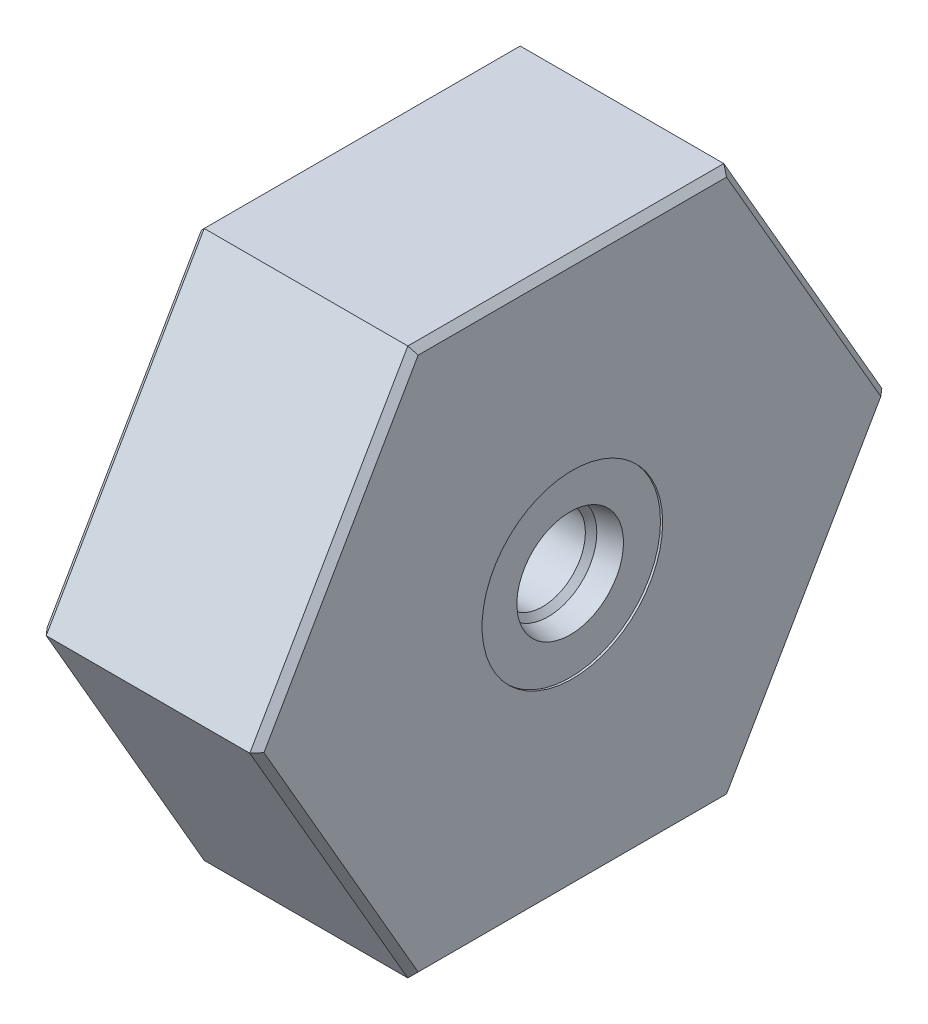
ISO-10303-21;
HEADER;
FILE_DESCRIPTION(('STEP AP214'),'2;1');
FILE_NAME('part.step','',(''),(''),'','','');
FILE_SCHEMA(('AUTOMOTIVE_DESIGN { 1 0 10303 214 1 1 1 1 }'));
ENDSEC;
DATA;
#1=APPLICATION_CONTEXT('core data for automotive mechanical design processes');
#2=APPLICATION_PROTOCOL_DEFINITION('international standard','automotive_design',2000,#1);
#3=PRODUCT_CONTEXT('',#1,'mechanical');
#4=PRODUCT('Part','Part','',(#3));
#5=PRODUCT_RELATED_PRODUCT_CATEGORY('part','',(#4));
#6=PRODUCT_DEFINITION_FORMATION('','',#4);
#7=PRODUCT_DEFINITION_CONTEXT('part definition',#1,'design');
#8=PRODUCT_DEFINITION('design','',#6,#7);
#9=PRODUCT_DEFINITION_SHAPE('','',#8);
#10=(LENGTH_UNIT() NAMED_UNIT(*) SI_UNIT(.MILLI.,.METRE.));
#11=(NAMED_UNIT(*) PLANE_ANGLE_UNIT() SI_UNIT($,.RADIAN.));
#12=(NAMED_UNIT(*) SI_UNIT($,.STERADIAN.) SOLID_ANGLE_UNIT());
#13=UNCERTAINTY_MEASURE_WITH_UNIT(LENGTH_MEASURE(1.E-05),#10,'distance_accuracy_value','');
#14=(GEOMETRIC_REPRESENTATION_CONTEXT(3) GLOBAL_UNCERTAINTY_ASSIGNED_CONTEXT((#13)) GLOBAL_UNIT_ASSIGNED_CONTEXT((#10,
#11,#12)) REPRESENTATION_CONTEXT('',''));
#15=CARTESIAN_POINT('',(0.,0.,0.));
#16=DIRECTION('',(0.,0.,1.));
#17=DIRECTION('',(1.,0.,0.));
#18=AXIS2_PLACEMENT_3D('',#15,#16,#17);
#19=CARTESIAN_POINT('',(25.146,-31.75,-18.3308710467706));
#20=DIRECTION('',(0.,-1.,0.));
#21=DIRECTION('',(0.,0.,-1.));
#22=AXIS2_PLACEMENT_3D('',#19,#20,#21);
#23=PLANE('',#22);
#24=DIRECTION('',(-1.,0.,0.));
#25=VECTOR('',#24,1.);
#26=CARTESIAN_POINT('',(25.146,-31.75,-18.3308710467706));
#27=LINE('',#26,#25);
#28=CARTESIAN_POINT('',(24.384,-31.75,-18.3308710467706));
#29=VERTEX_POINT('',#28);
#30=CARTESIAN_POINT('',(0.761999999999999,-31.75,-18.3308710467706));
#31=VERTEX_POINT('',#30);
#32=EDGE_CURVE('E261',#29,#31,#27,.T.);
#33=ORIENTED_EDGE('',*,*,#32,.F.);
#34=DIRECTION('',(0.,0.,1.));
#35=VECTOR('',#34,1.);
#36=CARTESIAN_POINT('',(24.384,-31.75,18.3308710467706));
#37=LINE('',#36,#35);
#38=CARTESIAN_POINT('',(24.384,-31.75,18.3308710467706));
#39=VERTEX_POINT('',#38);
#40=EDGE_CURVE('E42',#29,#39,#37,.T.);
#41=ORIENTED_EDGE('',*,*,#40,.T.);
#42=DIRECTION('',(-1.,0.,0.));
#43=VECTOR('',#42,1.);
#44=CARTESIAN_POINT('',(25.146,-31.75,18.3308710467706));
#45=LINE('',#44,#43);
#46=CARTESIAN_POINT('',(0.761999999999999,-31.75,18.3308710467706));
#47=VERTEX_POINT('',#46);
#48=EDGE_CURVE('E237',#39,#47,#45,.T.);
#49=ORIENTED_EDGE('',*,*,#48,.T.);
#50=DIRECTION('',(0.,0.,-1.));
#51=VECTOR('',#50,1.);
#52=CARTESIAN_POINT('',(0.761999999999999,-31.75,-18.3308710467706));
#53=LINE('',#52,#51);
#54=EDGE_CURVE('E150',#47,#31,#53,.T.);
#55=ORIENTED_EDGE('',*,*,#54,.T.);
#56=EDGE_LOOP('',(#33,#41,#49,#55));
#57=FACE_BOUND('',#56,.T.);
#58=ADVANCED_FACE('F33',(#57),#23,.T.);
#59=CARTESIAN_POINT('',(25.146,0.,-36.6617420935412));
#60=DIRECTION('',(0.,-0.5,-0.866025403784439));
#61=DIRECTION('',(0.,0.866025403784439,-0.5));
#62=AXIS2_PLACEMENT_3D('',#59,#60,#61);
#63=PLANE('',#62);
#64=DIRECTION('',(-1.,0.,0.));
#65=VECTOR('',#64,1.);
#66=CARTESIAN_POINT('',(25.146,0.,-36.6617420935412));
#67=LINE('',#66,#65);
#68=CARTESIAN_POINT('',(24.384,0.,-36.6617420935412));
#69=VERTEX_POINT('',#68);
#70=CARTESIAN_POINT('',(0.761999999999999,0.,-36.6617420935412));
#71=VERTEX_POINT('',#70);
#72=EDGE_CURVE('E259',#69,#71,#67,.T.);
#73=ORIENTED_EDGE('',*,*,#72,.F.);
#74=DIRECTION('',(0.,-0.866025403784439,0.5));
#75=VECTOR('',#74,1.);
#76=CARTESIAN_POINT('',(24.384,-31.75,-18.3308710467706));
#77=LINE('',#76,#75);
#78=EDGE_CURVE('E179',#69,#29,#77,.T.);
#79=ORIENTED_EDGE('',*,*,#78,.T.);
#80=ORIENTED_EDGE('',*,*,#32,.T.);
#81=DIRECTION('',(0.,0.866025403784439,-0.5));
#82=VECTOR('',#81,1.);
#83=CARTESIAN_POINT('',(0.761999999999995,0.,-36.6617420935412));
#84=LINE('',#83,#82);
#85=EDGE_CURVE('E218',#31,#71,#84,.T.);
#86=ORIENTED_EDGE('',*,*,#85,.T.);
#87=EDGE_LOOP('',(#73,#79,#80,#86));
#88=FACE_BOUND('',#87,.T.);
#89=ADVANCED_FACE('F342',(#88),#63,.T.);
#90=CARTESIAN_POINT('',(25.146,31.75,-18.3308710467706));
#91=DIRECTION('',(0.,0.5,-0.866025403784439));
#92=DIRECTION('',(0.,0.866025403784439,0.5));
#93=AXIS2_PLACEMENT_3D('',#90,#91,#92);
#94=PLANE('',#93);
#95=DIRECTION('',(-1.,0.,0.));
#96=VECTOR('',#95,1.);
#97=CARTESIAN_POINT('',(25.146,31.75,-18.3308710467706));
#98=LINE('',#97,#96);
#99=CARTESIAN_POINT('',(24.384,31.75,-18.3308710467706));
#100=VERTEX_POINT('',#99);
#101=CARTESIAN_POINT('',(0.761999999999999,31.75,-18.3308710467706));
#102=VERTEX_POINT('',#101);
#103=EDGE_CURVE('E257',#100,#102,#98,.T.);
#104=ORIENTED_EDGE('',*,*,#103,.F.);
#105=DIRECTION('',(0.,-0.866025403784439,-0.5));
#106=VECTOR('',#105,1.);
#107=CARTESIAN_POINT('',(24.384,0.,-36.6617420935412));
#108=LINE('',#107,#106);
#109=EDGE_CURVE('E160',#100,#69,#108,.T.);
#110=ORIENTED_EDGE('',*,*,#109,.T.);
#111=ORIENTED_EDGE('',*,*,#72,.T.);
#112=DIRECTION('',(0.,0.866025403784439,0.5));
#113=VECTOR('',#112,1.);
#114=CARTESIAN_POINT('',(0.762000000000002,31.75,-18.3308710467706));
#115=LINE('',#114,#113);
#116=EDGE_CURVE('E222',#71,#102,#115,.T.);
#117=ORIENTED_EDGE('',*,*,#116,.T.);
#118=EDGE_LOOP('',(#104,#110,#111,#117));
#119=FACE_BOUND('',#118,.T.);
#120=ADVANCED_FACE('F256',(#119),#94,.T.);
#121=CARTESIAN_POINT('',(25.146,31.75,18.3308710467706));
#122=DIRECTION('',(0.,1.,0.));
#123=DIRECTION('',(0.,0.,1.));
#124=AXIS2_PLACEMENT_3D('',#121,#122,#123);
#125=PLANE('',#124);
#126=DIRECTION('',(-1.,0.,0.));
#127=VECTOR('',#126,1.);
#128=CARTESIAN_POINT('',(25.146,31.75,18.3308710467706));
#129=LINE('',#128,#127);
#130=CARTESIAN_POINT('',(24.384,31.75,18.3308710467706));
#131=VERTEX_POINT('',#130);
#132=CARTESIAN_POINT('',(0.761999999999999,31.75,18.3308710467706));
#133=VERTEX_POINT('',#132);
#134=EDGE_CURVE('E265',#131,#133,#129,.T.);
#135=ORIENTED_EDGE('',*,*,#134,.F.);
#136=DIRECTION('',(0.,0.,-1.));
#137=VECTOR('',#136,1.);
#138=CARTESIAN_POINT('',(24.384,31.75,-18.3308710467706));
#139=LINE('',#138,#137);
#140=EDGE_CURVE('E177',#131,#100,#139,.T.);
#141=ORIENTED_EDGE('',*,*,#140,.T.);
#142=ORIENTED_EDGE('',*,*,#103,.T.);
#143=DIRECTION('',(0.,0.,1.));
#144=VECTOR('',#143,1.);
#145=CARTESIAN_POINT('',(0.761999999999999,31.75,18.3308710467706));
#146=LINE('',#145,#144);
#147=EDGE_CURVE('E221',#102,#133,#146,.T.);
#148=ORIENTED_EDGE('',*,*,#147,.T.);
#149=EDGE_LOOP('',(#135,#141,#142,#148));
#150=FACE_BOUND('',#149,.T.);
#151=ADVANCED_FACE('F395',(#150),#125,.T.);
#152=CARTESIAN_POINT('',(25.146,0.,36.6617420935412));
#153=DIRECTION('',(0.,0.5,0.866025403784439));
#154=DIRECTION('',(0.,-0.866025403784439,0.5));
#155=AXIS2_PLACEMENT_3D('',#152,#153,#154);
#156=PLANE('',#155);
#157=DIRECTION('',(-1.,0.,0.));
#158=VECTOR('',#157,1.);
#159=CARTESIAN_POINT('',(25.146,0.,36.6617420935412));
#160=LINE('',#159,#158);
#161=CARTESIAN_POINT('',(24.384,0.,36.6617420935412));
#162=VERTEX_POINT('',#161);
#163=CARTESIAN_POINT('',(0.761999999999999,0.,36.6617420935412));
#164=VERTEX_POINT('',#163);
#165=EDGE_CURVE('E238',#162,#164,#160,.T.);
#166=ORIENTED_EDGE('',*,*,#165,.F.);
#167=DIRECTION('',(0.,0.866025403784439,-0.5));
#168=VECTOR('',#167,1.);
#169=CARTESIAN_POINT('',(24.384,31.75,18.3308710467706));
#170=LINE('',#169,#168);
#171=EDGE_CURVE('E181',#162,#131,#170,.T.);
#172=ORIENTED_EDGE('',*,*,#171,.T.);
#173=ORIENTED_EDGE('',*,*,#134,.T.);
#174=DIRECTION('',(0.,-0.866025403784439,0.5));
#175=VECTOR('',#174,1.);
#176=CARTESIAN_POINT('',(0.761999999999995,0.,36.6617420935412));
#177=LINE('',#176,#175);
#178=EDGE_CURVE('E231',#133,#164,#177,.T.);
#179=ORIENTED_EDGE('',*,*,#178,.T.);
#180=EDGE_LOOP('',(#166,#172,#173,#179));
#181=FACE_BOUND('',#180,.T.);
#182=ADVANCED_FACE('F338',(#181),#156,.T.);
#183=CARTESIAN_POINT('',(25.146,-31.75,18.3308710467706));
#184=DIRECTION('',(0.,-0.5,0.866025403784439));
#185=DIRECTION('',(0.,-0.866025403784439,-0.5));
#186=AXIS2_PLACEMENT_3D('',#183,#184,#185);
#187=PLANE('',#186);
#188=ORIENTED_EDGE('',*,*,#48,.F.);
#189=DIRECTION('',(0.,0.866025403784439,0.5));
#190=VECTOR('',#189,1.);
#191=CARTESIAN_POINT('',(24.384,0.,36.6617420935412));
#192=LINE('',#191,#190);
#193=EDGE_CURVE('E11',#39,#162,#192,.T.);
#194=ORIENTED_EDGE('',*,*,#193,.T.);
#195=ORIENTED_EDGE('',*,*,#165,.T.);
#196=DIRECTION('',(0.,-0.866025403784439,-0.5));
#197=VECTOR('',#196,1.);
#198=CARTESIAN_POINT('',(0.761999999999999,-31.75,18.3308710467706));
#199=LINE('',#198,#197);
#200=EDGE_CURVE('E164',#164,#47,#199,.T.);
#201=ORIENTED_EDGE('',*,*,#200,.T.);
#202=EDGE_LOOP('',(#188,#194,#195,#201));
#203=FACE_BOUND('',#202,.T.);
#204=ADVANCED_FACE('F236',(#203),#187,.T.);
#205=CARTESIAN_POINT('',(25.146,-31.75,18.3308710467706));
#206=DIRECTION('',(-1.,0.,0.));
#207=DIRECTION('',(0.,0.,1.));
#208=AXIS2_PLACEMENT_3D('',#205,#206,#207);
#209=PLANE('',#208);
#210=DIRECTION('',(0.,0.866025403784439,-0.5));
#211=VECTOR('',#210,1.);
#212=CARTESIAN_POINT('',(25.146,0.381000000000001,-36.0018307358575));
#213=LINE('',#212,#211);
#214=CARTESIAN_POINT('',(25.146,-30.988,-17.8909301416481));
#215=VERTEX_POINT('',#214);
#216=CARTESIAN_POINT('',(25.146,0.,-35.7818602832962));
#217=VERTEX_POINT('',#216);
#218=EDGE_CURVE('E170',#215,#217,#213,.T.);
#219=ORIENTED_EDGE('',*,*,#218,.T.);
#220=DIRECTION('',(0.,0.866025403784439,0.5));
#221=VECTOR('',#220,1.);
#222=CARTESIAN_POINT('',(25.146,31.369,-17.6709596890869));
#223=LINE('',#222,#221);
#224=CARTESIAN_POINT('',(25.146,30.988,-17.8909301416481));
#225=VERTEX_POINT('',#224);
#226=EDGE_CURVE('E174',#217,#225,#223,.T.);
#227=ORIENTED_EDGE('',*,*,#226,.T.);
#228=DIRECTION('',(0.,0.,1.));
#229=VECTOR('',#228,1.);
#230=CARTESIAN_POINT('',(25.146,30.988,18.3308710467706));
#231=LINE('',#230,#229);
#232=CARTESIAN_POINT('',(25.146,30.988,17.8909301416481));
#233=VERTEX_POINT('',#232);
#234=EDGE_CURVE('E172',#225,#233,#231,.T.);
#235=ORIENTED_EDGE('',*,*,#234,.T.);
#236=DIRECTION('',(0.,-0.866025403784439,0.5));
#237=VECTOR('',#236,1.);
#238=CARTESIAN_POINT('',(25.146,-0.381000000000001,36.0018307358575));
#239=LINE('',#238,#237);
#240=CARTESIAN_POINT('',(25.146,0.,35.7818602832962));
#241=VERTEX_POINT('',#240);
#242=EDGE_CURVE('E168',#233,#241,#239,.T.);
#243=ORIENTED_EDGE('',*,*,#242,.T.);
#244=DIRECTION('',(0.,-0.866025403784439,-0.5));
#245=VECTOR('',#244,1.);
#246=CARTESIAN_POINT('',(25.146,-31.369,17.6709596890869));
#247=LINE('',#246,#245);
#248=CARTESIAN_POINT('',(25.146,-30.988,17.8909301416481));
#249=VERTEX_POINT('',#248);
#250=EDGE_CURVE('E163',#241,#249,#247,.T.);
#251=ORIENTED_EDGE('',*,*,#250,.T.);
#252=DIRECTION('',(0.,0.,-1.));
#253=VECTOR('',#252,1.);
#254=CARTESIAN_POINT('',(25.146,-30.988,-18.3308710467706));
#255=LINE('',#254,#253);
#256=EDGE_CURVE('E166',#249,#215,#255,.T.);
#257=ORIENTED_EDGE('',*,*,#256,.T.);
#258=EDGE_LOOP('',(#219,#227,#235,#243,#251,#257));
#259=FACE_BOUND('',#258,.T.);
#260=CARTESIAN_POINT('',(25.146,0.,0.));
#261=DIRECTION('',(1.,0.,0.));
#262=DIRECTION('',(0.,0.,-1.));
#263=AXIS2_PLACEMENT_3D('',#260,#261,#262);
#264=CIRCLE('',#263,10.4774999999981);
#265=CARTESIAN_POINT('',(25.146,0.,-10.4774999999981));
#266=VERTEX_POINT('',#265);
#267=EDGE_CURVE('E272',#266,#266,#264,.T.);
#268=ORIENTED_EDGE('',*,*,#267,.F.);
#269=EDGE_LOOP('',(#268));
#270=FACE_BOUND('',#269,.T.);
#271=ADVANCED_FACE('F328',(#259,#270),#209,.F.);
#272=CARTESIAN_POINT('',(0.,-31.75,18.3308710467706));
#273=DIRECTION('',(-1.,0.,0.));
#274=DIRECTION('',(0.,0.,1.));
#275=AXIS2_PLACEMENT_3D('',#272,#273,#274);
#276=PLANE('',#275);
#277=DIRECTION('',(0.,0.,-1.));
#278=VECTOR('',#277,1.);
#279=CARTESIAN_POINT('',(0.,30.988,18.3308710467706));
#280=LINE('',#279,#278);
#281=CARTESIAN_POINT('',(0.,30.988,17.8909301416481));
#282=VERTEX_POINT('',#281);
#283=CARTESIAN_POINT('',(0.,30.988,-17.8909301416481));
#284=VERTEX_POINT('',#283);
#285=EDGE_CURVE('E134',#282,#284,#280,.T.);
#286=ORIENTED_EDGE('',*,*,#285,.T.);
#287=DIRECTION('',(0.,-0.866025403784439,-0.5));
#288=VECTOR('',#287,1.);
#289=CARTESIAN_POINT('',(0.,-0.381000000000013,-36.0018307358575));
#290=LINE('',#289,#288);
#291=CARTESIAN_POINT('',(0.,0.,-35.7818602832962));
#292=VERTEX_POINT('',#291);
#293=EDGE_CURVE('E227',#284,#292,#290,.T.);
#294=ORIENTED_EDGE('',*,*,#293,.T.);
#295=DIRECTION('',(0.,-0.866025403784439,0.5));
#296=VECTOR('',#295,1.);
#297=CARTESIAN_POINT('',(0.,-47.244,-8.50552416570158));
#298=LINE('',#297,#296);
#299=CARTESIAN_POINT('',(0.,-30.988,-17.8909301416481));
#300=VERTEX_POINT('',#299);
#301=EDGE_CURVE('E129',#292,#300,#298,.T.);
#302=ORIENTED_EDGE('',*,*,#301,.T.);
#303=DIRECTION('',(0.,0.,1.));
#304=VECTOR('',#303,1.);
#305=CARTESIAN_POINT('',(0.,-30.988,18.3308710467706));
#306=LINE('',#305,#304);
#307=CARTESIAN_POINT('',(0.,-30.988,17.8909301416481));
#308=VERTEX_POINT('',#307);
#309=EDGE_CURVE('E121',#300,#308,#306,.T.);
#310=ORIENTED_EDGE('',*,*,#309,.T.);
#311=DIRECTION('',(0.,0.866025403784439,0.5));
#312=VECTOR('',#311,1.);
#313=CARTESIAN_POINT('',(0.,-31.369,17.6709596890869));
#314=LINE('',#313,#312);
#315=CARTESIAN_POINT('',(0.,0.,35.7818602832962));
#316=VERTEX_POINT('',#315);
#317=EDGE_CURVE('E125',#308,#316,#314,.T.);
#318=ORIENTED_EDGE('',*,*,#317,.T.);
#319=DIRECTION('',(0.,0.866025403784439,-0.5));
#320=VECTOR('',#319,1.);
#321=CARTESIAN_POINT('',(0.,-16.256,45.1672662592428));
#322=LINE('',#321,#320);
#323=EDGE_CURVE('E135',#316,#282,#322,.T.);
#324=ORIENTED_EDGE('',*,*,#323,.T.);
#325=EDGE_LOOP('',(#286,#294,#302,#310,#318,#324));
#326=FACE_BOUND('',#325,.T.);
#327=CARTESIAN_POINT('',(0.,0.,0.));
#328=DIRECTION('',(-1.,0.,0.));
#329=DIRECTION('',(0.,0.,1.));
#330=AXIS2_PLACEMENT_3D('',#327,#328,#329);
#331=CIRCLE('',#330,28.0542999999999);
#332=CARTESIAN_POINT('',(0.,0.,28.0542999999999));
#333=VERTEX_POINT('',#332);
#334=EDGE_CURVE('E263',#333,#333,#331,.F.);
#335=ORIENTED_EDGE('',*,*,#334,.T.);
#336=EDGE_LOOP('',(#335));
#337=FACE_BOUND('',#336,.T.);
#338=ADVANCED_FACE('F123',(#326,#337),#276,.T.);
#339=CARTESIAN_POINT('',(0.,0.,0.));
#340=DIRECTION('',(1.,0.,0.));
#341=DIRECTION('',(0.,0.,-1.));
#342=AXIS2_PLACEMENT_3D('',#339,#340,#341);
#343=CYLINDRICAL_SURFACE('',#342,27.8003);
#344=CARTESIAN_POINT('',(0.253999999999931,0.,0.));
#345=DIRECTION('',(-1.,0.,0.));
#346=DIRECTION('',(0.,0.,1.));
#347=AXIS2_PLACEMENT_3D('',#344,#345,#346);
#348=CIRCLE('',#347,27.8003);
#349=CARTESIAN_POINT('',(0.253999999999931,0.,27.8003));
#350=VERTEX_POINT('',#349);
#351=EDGE_CURVE('E275',#350,#350,#348,.T.);
#352=ORIENTED_EDGE('',*,*,#351,.T.);
#353=EDGE_LOOP('',(#352));
#354=FACE_BOUND('',#353,.T.);
#355=CARTESIAN_POINT('',(12.2344103093925,0.,0.));
#356=DIRECTION('',(1.,0.,0.));
#357=DIRECTION('',(0.,0.,-1.));
#358=AXIS2_PLACEMENT_3D('',#355,#356,#357);
#359=CIRCLE('',#358,27.8003);
#360=CARTESIAN_POINT('',(12.2344103093925,0.,-27.8003));
#361=VERTEX_POINT('',#360);
#362=EDGE_CURVE('E312',#361,#361,#359,.T.);
#363=ORIENTED_EDGE('',*,*,#362,.T.);
#364=EDGE_LOOP('',(#363));
#365=FACE_BOUND('',#364,.T.);
#366=ADVANCED_FACE('F336',(#354,#365),#343,.F.);
#367=CARTESIAN_POINT('',(0.,0.,0.));
#368=DIRECTION('',(1.,0.,0.));
#369=DIRECTION('',(0.,0.,-1.));
#370=AXIS2_PLACEMENT_3D('',#367,#368,#369);
#371=CYLINDRICAL_SURFACE('',#370,10.4774999999981);
#372=CARTESIAN_POINT('',(24.8920000000245,0.,0.));
#373=DIRECTION('',(1.,0.,0.));
#374=DIRECTION('',(0.,0.,-1.));
#375=AXIS2_PLACEMENT_3D('',#372,#373,#374);
#376=CIRCLE('',#375,10.4774999999981);
#377=CARTESIAN_POINT('',(24.8920000000245,0.,-10.4774999999981));
#378=VERTEX_POINT('',#377);
#379=EDGE_CURVE('E321',#378,#378,#376,.T.);
#380=ORIENTED_EDGE('',*,*,#379,.F.);
#381=EDGE_LOOP('',(#380));
#382=FACE_BOUND('',#381,.T.);
#383=ORIENTED_EDGE('',*,*,#267,.T.);
#384=EDGE_LOOP('',(#383));
#385=FACE_BOUND('',#384,.T.);
#386=ADVANCED_FACE('F326',(#382,#385),#371,.F.);
#387=CARTESIAN_POINT('',(24.8920000000245,10.4774999999981,0.));
#388=DIRECTION('',(-1.,0.,0.));
#389=DIRECTION('',(0.,0.,1.));
#390=AXIS2_PLACEMENT_3D('',#387,#388,#389);
#391=PLANE('',#390);
#392=CARTESIAN_POINT('',(24.8920000000245,0.,0.));
#393=DIRECTION('',(1.,0.,0.));
#394=DIRECTION('',(0.,0.,-1.));
#395=AXIS2_PLACEMENT_3D('',#392,#393,#394);
#396=CIRCLE('',#395,6.18490000001606);
#397=CARTESIAN_POINT('',(24.8920000000245,0.,-6.18490000001606));
#398=VERTEX_POINT('',#397);
#399=EDGE_CURVE('E318',#398,#398,#396,.T.);
#400=ORIENTED_EDGE('',*,*,#399,.F.);
#401=EDGE_LOOP('',(#400));
#402=FACE_BOUND('',#401,.T.);
#403=ORIENTED_EDGE('',*,*,#379,.T.);
#404=EDGE_LOOP('',(#403));
#405=FACE_BOUND('',#404,.T.);
#406=ADVANCED_FACE('F566',(#402,#405),#391,.F.);
#407=CARTESIAN_POINT('',(24.8920000000245,0.,0.));
#408=DIRECTION('',(1.,0.,0.));
#409=DIRECTION('',(0.,0.,-1.));
#410=AXIS2_PLACEMENT_3D('',#407,#408,#409);
#411=CONICAL_SURFACE('',#410,6.18490000001606,0.209439510243191);
#412=CARTESIAN_POINT('',(22.3393000000007,0.,0.));
#413=DIRECTION('',(1.,0.,0.));
#414=DIRECTION('',(0.,0.,-1.));
#415=AXIS2_PLACEMENT_3D('',#412,#413,#414);
#416=CIRCLE('',#415,5.6423068650256);
#417=CARTESIAN_POINT('',(22.3393000000007,0.,-5.6423068650256));
#418=VERTEX_POINT('',#417);
#419=EDGE_CURVE('E309',#418,#418,#416,.T.);
#420=ORIENTED_EDGE('',*,*,#419,.F.);
#421=EDGE_LOOP('',(#420));
#422=FACE_BOUND('',#421,.T.);
#423=ORIENTED_EDGE('',*,*,#399,.T.);
#424=EDGE_LOOP('',(#423));
#425=FACE_BOUND('',#424,.T.);
#426=ADVANCED_FACE('F557',(#422,#425),#411,.F.);
#427=CARTESIAN_POINT('',(22.3393000000007,0.,0.));
#428=DIRECTION('',(1.,0.,0.));
#429=DIRECTION('',(0.,0.,-1.));
#430=AXIS2_PLACEMENT_3D('',#427,#428,#429);
#431=CONICAL_SURFACE('',#430,5.6423068650256,0.785398163397452);
#432=CARTESIAN_POINT('',(21.6753931349751,0.,0.));
#433=DIRECTION('',(1.,0.,0.));
#434=DIRECTION('',(0.,0.,-1.));
#435=AXIS2_PLACEMENT_3D('',#432,#433,#434);
#436=CIRCLE('',#435,4.97839999999999);
#437=CARTESIAN_POINT('',(21.6753931349751,0.,-4.97839999999999));
#438=VERTEX_POINT('',#437);
#439=EDGE_CURVE('E305',#438,#438,#436,.T.);
#440=ORIENTED_EDGE('',*,*,#439,.F.);
#441=EDGE_LOOP('',(#440));
#442=FACE_BOUND('',#441,.T.);
#443=ORIENTED_EDGE('',*,*,#419,.T.);
#444=EDGE_LOOP('',(#443));
#445=FACE_BOUND('',#444,.T.);
#446=ADVANCED_FACE('F550',(#442,#445),#431,.F.);
#447=CARTESIAN_POINT('',(0.,0.,0.));
#448=DIRECTION('',(1.,0.,0.));
#449=DIRECTION('',(0.,0.,-1.));
#450=AXIS2_PLACEMENT_3D('',#447,#448,#449);
#451=CYLINDRICAL_SURFACE('',#450,4.9784);
#452=CARTESIAN_POINT('',(15.748,0.,0.));
#453=DIRECTION('',(1.,0.,0.));
#454=DIRECTION('',(0.,0.,-1.));
#455=AXIS2_PLACEMENT_3D('',#452,#453,#454);
#456=CIRCLE('',#455,4.9784);
#457=CARTESIAN_POINT('',(15.748,0.,-4.9784));
#458=VERTEX_POINT('',#457);
#459=EDGE_CURVE('E146',#458,#458,#456,.F.);
#460=ORIENTED_EDGE('',*,*,#459,.T.);
#461=EDGE_LOOP('',(#460));
#462=FACE_BOUND('',#461,.T.);
#463=ORIENTED_EDGE('',*,*,#439,.T.);
#464=EDGE_LOOP('',(#463));
#465=FACE_BOUND('',#464,.T.);
#466=ADVANCED_FACE('F283',(#462,#465),#451,.F.);
#467=CARTESIAN_POINT('',(14.986,4.9784,0.));
#468=DIRECTION('',(1.,0.,0.));
#469=DIRECTION('',(0.,0.,-1.));
#470=AXIS2_PLACEMENT_3D('',#467,#468,#469);
#471=PLANE('',#470);
#472=CARTESIAN_POINT('',(14.986,0.,0.));
#473=DIRECTION('',(1.,0.,0.));
#474=DIRECTION('',(0.,0.,-1.));
#475=AXIS2_PLACEMENT_3D('',#472,#473,#474);
#476=CIRCLE('',#475,5.74039999999998);
#477=CARTESIAN_POINT('',(14.986,0.,-5.74039999999998));
#478=VERTEX_POINT('',#477);
#479=EDGE_CURVE('E278',#478,#478,#476,.T.);
#480=ORIENTED_EDGE('',*,*,#479,.T.);
#481=EDGE_LOOP('',(#480));
#482=FACE_BOUND('',#481,.T.);
#483=CARTESIAN_POINT('',(14.986,15.24,0.));
#484=DIRECTION('',(-1.,0.,0.));
#485=DIRECTION('',(0.,0.,1.));
#486=AXIS2_PLACEMENT_3D('',#483,#484,#485);
#487=CIRCLE('',#486,8.00100000000001);
#488=CARTESIAN_POINT('',(14.986,15.24,8.00100000000001));
#489=VERTEX_POINT('',#488);
#490=EDGE_CURVE('E153',#489,#489,#487,.T.);
#491=ORIENTED_EDGE('',*,*,#490,.F.);
#492=EDGE_LOOP('',(#491));
#493=FACE_BOUND('',#492,.T.);
#494=CARTESIAN_POINT('',(14.986,0.,0.));
#495=DIRECTION('',(1.,0.,0.));
#496=DIRECTION('',(0.,0.,-1.));
#497=AXIS2_PLACEMENT_3D('',#494,#495,#496);
#498=CIRCLE('',#497,27.4955);
#499=CARTESIAN_POINT('',(14.986,0.,-27.4955));
#500=VERTEX_POINT('',#499);
#501=EDGE_CURVE('E303',#500,#500,#498,.T.);
#502=ORIENTED_EDGE('',*,*,#501,.F.);
#503=EDGE_LOOP('',(#502));
#504=FACE_BOUND('',#503,.T.);
#505=ADVANCED_FACE('F293',(#482,#493,#504),#471,.F.);
#506=CARTESIAN_POINT('',(0.,0.,0.));
#507=DIRECTION('',(1.,0.,0.));
#508=DIRECTION('',(0.,0.,-1.));
#509=AXIS2_PLACEMENT_3D('',#506,#507,#508);
#510=CYLINDRICAL_SURFACE('',#509,27.4955);
#511=CARTESIAN_POINT('',(12.7,0.,0.));
#512=DIRECTION('',(1.,0.,0.));
#513=DIRECTION('',(0.,0.,-1.));
#514=AXIS2_PLACEMENT_3D('',#511,#512,#513);
#515=CIRCLE('',#514,27.4954999999999);
#516=CARTESIAN_POINT('',(12.7,0.,-27.4954999999999));
#517=VERTEX_POINT('',#516);
#518=EDGE_CURVE('E306',#517,#517,#515,.T.);
#519=ORIENTED_EDGE('',*,*,#518,.F.);
#520=EDGE_LOOP('',(#519));
#521=FACE_BOUND('',#520,.T.);
#522=ORIENTED_EDGE('',*,*,#501,.T.);
#523=EDGE_LOOP('',(#522));
#524=FACE_BOUND('',#523,.T.);
#525=ADVANCED_FACE('F296',(#521,#524),#510,.F.);
#526=CARTESIAN_POINT('',(12.2344103093925,0.,0.));
#527=DIRECTION('',(1.,0.,0.));
#528=DIRECTION('',(0.,0.,-1.));
#529=AXIS2_PLACEMENT_3D('',#526,#527,#528);
#530=TOROIDAL_SURFACE('',#529,27.2923,0.508000000000005);
#531=ORIENTED_EDGE('',*,*,#362,.F.);
#532=EDGE_LOOP('',(#531));
#533=FACE_BOUND('',#532,.T.);
#534=ORIENTED_EDGE('',*,*,#518,.T.);
#535=EDGE_LOOP('',(#534));
#536=FACE_BOUND('',#535,.T.);
#537=ADVANCED_FACE('F521',(#533,#536),#530,.F.);
#538=CARTESIAN_POINT('',(17.272,15.24,0.));
#539=DIRECTION('',(1.,0.,0.));
#540=DIRECTION('',(0.,0.,-1.));
#541=AXIS2_PLACEMENT_3D('',#538,#539,#540);
#542=PLANE('',#541);
#543=CARTESIAN_POINT('',(17.272,15.24,0.));
#544=DIRECTION('',(-1.,0.,0.));
#545=DIRECTION('',(0.,0.,1.));
#546=AXIS2_PLACEMENT_3D('',#543,#544,#545);
#547=CIRCLE('',#546,8.00100000000001);
#548=CARTESIAN_POINT('',(17.272,15.24,8.00100000000001));
#549=VERTEX_POINT('',#548);
#550=EDGE_CURVE('E618',#549,#549,#547,.T.);
#551=ORIENTED_EDGE('',*,*,#550,.T.);
#552=EDGE_LOOP('',(#551));
#553=FACE_BOUND('',#552,.T.);
#554=ADVANCED_FACE('F512',(#553),#542,.F.);
#555=CARTESIAN_POINT('',(14.986,15.24,0.));
#556=DIRECTION('',(-1.,0.,0.));
#557=DIRECTION('',(0.,0.,1.));
#558=AXIS2_PLACEMENT_3D('',#555,#556,#557);
#559=CYLINDRICAL_SURFACE('',#558,8.00100000000001);
#560=ORIENTED_EDGE('',*,*,#550,.F.);
#561=EDGE_LOOP('',(#560));
#562=FACE_BOUND('',#561,.T.);
#563=ORIENTED_EDGE('',*,*,#490,.T.);
#564=EDGE_LOOP('',(#563));
#565=FACE_BOUND('',#564,.T.);
#566=ADVANCED_FACE('F351',(#562,#565),#559,.F.);
#567=CARTESIAN_POINT('',(0.,0.,0.));
#568=DIRECTION('',(-1.,0.,0.));
#569=DIRECTION('',(0.,0.,1.));
#570=AXIS2_PLACEMENT_3D('',#567,#568,#569);
#571=CONICAL_SURFACE('',#570,28.0542999999999,0.785398163397462);
#572=ORIENTED_EDGE('',*,*,#351,.F.);
#573=EDGE_LOOP('',(#572));
#574=FACE_BOUND('',#573,.T.);
#575=ORIENTED_EDGE('',*,*,#334,.F.);
#576=EDGE_LOOP('',(#575));
#577=FACE_BOUND('',#576,.T.);
#578=ADVANCED_FACE('F289',(#574,#577),#571,.F.);
#579=CARTESIAN_POINT('',(14.986,0.,0.));
#580=DIRECTION('',(-1.,0.,0.));
#581=DIRECTION('',(0.,0.,1.));
#582=AXIS2_PLACEMENT_3D('',#579,#580,#581);
#583=CONICAL_SURFACE('',#582,5.74039999999998,0.785398163397451);
#584=ORIENTED_EDGE('',*,*,#459,.F.);
#585=EDGE_LOOP('',(#584));
#586=FACE_BOUND('',#585,.T.);
#587=ORIENTED_EDGE('',*,*,#479,.F.);
#588=EDGE_LOOP('',(#587));
#589=FACE_BOUND('',#588,.T.);
#590=ADVANCED_FACE('F286',(#586,#589),#583,.F.);
#591=CARTESIAN_POINT('',(0.,-31.369,17.6709596890869));
#592=DIRECTION('',(0.707106781186548,0.353553390593273,-0.612372435695794));
#593=DIRECTION('',(-0.654653670707976,0.,-0.755928946018455));
#594=AXIS2_PLACEMENT_3D('',#591,#592,#593);
#595=PLANE('',#594);
#596=DIRECTION('',(0.654653670707977,-0.654653670707977,0.377964473009229));
#597=VECTOR('',#596,1.);
#598=CARTESIAN_POINT('',(0.108857142857142,-31.0968571428571,17.9537788423799));
#599=LINE('',#598,#597);
#600=EDGE_CURVE('E141',#47,#308,#599,.F.);
#601=ORIENTED_EDGE('',*,*,#600,.F.);
#602=ORIENTED_EDGE('',*,*,#200,.F.);
#603=DIRECTION('',(-0.654653670707976,0.,-0.755928946018455));
#604=VECTOR('',#603,1.);
#605=CARTESIAN_POINT('',(-8.96257142857143,0.,25.4327742294623));
#606=LINE('',#605,#604);
#607=EDGE_CURVE('E144',#316,#164,#606,.F.);
#608=ORIENTED_EDGE('',*,*,#607,.F.);
#609=ORIENTED_EDGE('',*,*,#317,.F.);
#610=EDGE_LOOP('',(#601,#602,#608,#609));
#611=FACE_BOUND('',#610,.T.);
#612=ADVANCED_FACE('F139',(#611),#595,.F.);
#613=CARTESIAN_POINT('',(0.,-16.256,45.1672662592428));
#614=DIRECTION('',(0.707106781186548,-0.353553390593273,-0.612372435695794));
#615=DIRECTION('',(-0.654653670707976,0.,-0.755928946018455));
#616=AXIS2_PLACEMENT_3D('',#613,#614,#615);
#617=PLANE('',#616);
#618=ORIENTED_EDGE('',*,*,#607,.T.);
#619=ORIENTED_EDGE('',*,*,#178,.F.);
#620=DIRECTION('',(-0.654653670707977,-0.654653670707977,-0.377964473009229));
#621=VECTOR('',#620,1.);
#622=CARTESIAN_POINT('',(-13.4982857142857,17.4897142857143,10.0976912509068));
#623=LINE('',#622,#621);
#624=EDGE_CURVE('E151',#282,#133,#623,.F.);
#625=ORIENTED_EDGE('',*,*,#624,.F.);
#626=ORIENTED_EDGE('',*,*,#323,.F.);
#627=EDGE_LOOP('',(#618,#619,#625,#626));
#628=FACE_BOUND('',#627,.T.);
#629=ADVANCED_FACE('F240',(#628),#617,.F.);
#630=CARTESIAN_POINT('',(0.,-30.988,18.3308710467706));
#631=DIRECTION('',(0.707106781186548,0.707106781186548,0.));
#632=DIRECTION('',(-0.707106781186548,0.707106781186548,0.));
#633=AXIS2_PLACEMENT_3D('',#630,#631,#632);
#634=PLANE('',#633);
#635=ORIENTED_EDGE('',*,*,#600,.T.);
#636=ORIENTED_EDGE('',*,*,#309,.F.);
#637=DIRECTION('',(0.654653670707977,-0.654653670707977,-0.377964473009227));
#638=VECTOR('',#637,1.);
#639=CARTESIAN_POINT('',(-8.96257142857143,-22.0254285714286,-12.7163871147312));
#640=LINE('',#639,#638);
#641=EDGE_CURVE('E156',#31,#300,#640,.F.);
#642=ORIENTED_EDGE('',*,*,#641,.F.);
#643=ORIENTED_EDGE('',*,*,#54,.F.);
#644=EDGE_LOOP('',(#635,#636,#642,#643));
#645=FACE_BOUND('',#644,.T.);
#646=ADVANCED_FACE('F148',(#645),#634,.F.);
#647=CARTESIAN_POINT('',(0.,30.988,18.3308710467706));
#648=DIRECTION('',(0.707106781186548,-0.707106781186548,0.));
#649=DIRECTION('',(0.707106781186548,0.707106781186548,0.));
#650=AXIS2_PLACEMENT_3D('',#647,#648,#649);
#651=PLANE('',#650);
#652=ORIENTED_EDGE('',*,*,#624,.T.);
#653=ORIENTED_EDGE('',*,*,#147,.F.);
#654=DIRECTION('',(-0.654653670707976,-0.654653670707976,0.377964473009232));
#655=VECTOR('',#654,1.);
#656=CARTESIAN_POINT('',(-8.96257142857151,22.0254285714285,-12.716387114731));
#657=LINE('',#656,#655);
#658=EDGE_CURVE('E204',#284,#102,#657,.F.);
#659=ORIENTED_EDGE('',*,*,#658,.F.);
#660=ORIENTED_EDGE('',*,*,#285,.F.);
#661=EDGE_LOOP('',(#652,#653,#659,#660));
#662=FACE_BOUND('',#661,.T.);
#663=ADVANCED_FACE('F251',(#662),#651,.F.);
#664=CARTESIAN_POINT('',(0.,-47.244,-8.50552416570158));
#665=DIRECTION('',(0.707106781186548,0.353553390593274,0.612372435695795));
#666=DIRECTION('',(0.654653670707977,0.,-0.755928946018454));
#667=AXIS2_PLACEMENT_3D('',#664,#665,#666);
#668=PLANE('',#667);
#669=ORIENTED_EDGE('',*,*,#641,.T.);
#670=ORIENTED_EDGE('',*,*,#301,.F.);
#671=DIRECTION('',(0.654653670707976,0.,-0.755928946018456));
#672=VECTOR('',#671,1.);
#673=CARTESIAN_POINT('',(-13.4982857142858,-1.04083408558608E-13,-20.1953825018134));
#674=LINE('',#673,#672);
#675=EDGE_CURVE('E199',#71,#292,#674,.F.);
#676=ORIENTED_EDGE('',*,*,#675,.F.);
#677=ORIENTED_EDGE('',*,*,#85,.F.);
#678=EDGE_LOOP('',(#669,#670,#676,#677));
#679=FACE_BOUND('',#678,.T.);
#680=ADVANCED_FACE('F216',(#679),#668,.F.);
#681=CARTESIAN_POINT('',(0.,-0.381000000000013,-36.0018307358575));
#682=DIRECTION('',(0.70710678118655,-0.353553390593273,0.612372435695792));
#683=DIRECTION('',(0.654653670707975,0.,-0.755928946018457));
#684=AXIS2_PLACEMENT_3D('',#681,#682,#683);
#685=PLANE('',#684);
#686=ORIENTED_EDGE('',*,*,#658,.T.);
#687=ORIENTED_EDGE('',*,*,#116,.F.);
#688=ORIENTED_EDGE('',*,*,#675,.T.);
#689=ORIENTED_EDGE('',*,*,#293,.F.);
#690=EDGE_LOOP('',(#686,#687,#688,#689));
#691=FACE_BOUND('',#690,.T.);
#692=ADVANCED_FACE('F248',(#691),#685,.F.);
#693=CARTESIAN_POINT('',(24.384,-31.75,18.3308710467706));
#694=DIRECTION('',(0.707106781186555,-0.35355339059327,0.612372435695788));
#695=DIRECTION('',(0.654653670707969,0.,-0.755928946018462));
#696=AXIS2_PLACEMENT_3D('',#693,#694,#695);
#697=PLANE('',#696);
#698=DIRECTION('',(0.654653670707969,0.654653670707984,-0.377964473009231));
#699=VECTOR('',#698,1.);
#700=CARTESIAN_POINT('',(24.384,-31.75,18.3308710467706));
#701=LINE('',#700,#699);
#702=EDGE_CURVE('E193',#249,#39,#701,.F.);
#703=ORIENTED_EDGE('',*,*,#702,.F.);
#704=ORIENTED_EDGE('',*,*,#250,.F.);
#705=DIRECTION('',(-0.654653670707969,0.,0.755928946018462));
#706=VECTOR('',#705,1.);
#707=CARTESIAN_POINT('',(33.4554285714285,0.,26.1869586382435));
#708=LINE('',#707,#706);
#709=EDGE_CURVE('E37',#162,#241,#708,.F.);
#710=ORIENTED_EDGE('',*,*,#709,.F.);
#711=ORIENTED_EDGE('',*,*,#193,.F.);
#712=EDGE_LOOP('',(#703,#704,#710,#711));
#713=FACE_BOUND('',#712,.T.);
#714=ADVANCED_FACE('F35',(#713),#697,.T.);
#715=CARTESIAN_POINT('',(24.384,0.,36.6617420935412));
#716=DIRECTION('',(0.707106781186556,0.35355339059327,0.612372435695788));
#717=DIRECTION('',(0.654653670707969,0.,-0.755928946018462));
#718=AXIS2_PLACEMENT_3D('',#715,#716,#717);
#719=PLANE('',#718);
#720=ORIENTED_EDGE('',*,*,#709,.T.);
#721=ORIENTED_EDGE('',*,*,#242,.F.);
#722=DIRECTION('',(-0.654653670707969,0.654653670707981,0.377964473009233));
#723=VECTOR('',#722,1.);
#724=CARTESIAN_POINT('',(33.4554285714285,22.6785714285714,13.0934793191218));
#725=LINE('',#724,#723);
#726=EDGE_CURVE('E191',#131,#233,#725,.F.);
#727=ORIENTED_EDGE('',*,*,#726,.F.);
#728=ORIENTED_EDGE('',*,*,#171,.F.);
#729=EDGE_LOOP('',(#720,#721,#727,#728));
#730=FACE_BOUND('',#729,.T.);
#731=ADVANCED_FACE('F380',(#730),#719,.T.);
#732=CARTESIAN_POINT('',(24.384,-31.75,-18.3308710467706));
#733=DIRECTION('',(0.707106781186556,-0.707106781186539,0.));
#734=DIRECTION('',(0.707106781186539,0.707106781186556,0.));
#735=AXIS2_PLACEMENT_3D('',#732,#733,#734);
#736=PLANE('',#735);
#737=ORIENTED_EDGE('',*,*,#702,.T.);
#738=ORIENTED_EDGE('',*,*,#40,.F.);
#739=DIRECTION('',(0.654653670707969,0.654653670707984,0.377964473009231));
#740=VECTOR('',#739,1.);
#741=CARTESIAN_POINT('',(24.384,-31.75,-18.3308710467706));
#742=LINE('',#741,#740);
#743=EDGE_CURVE('E188',#215,#29,#742,.F.);
#744=ORIENTED_EDGE('',*,*,#743,.F.);
#745=ORIENTED_EDGE('',*,*,#256,.F.);
#746=EDGE_LOOP('',(#737,#738,#744,#745));
#747=FACE_BOUND('',#746,.T.);
#748=ADVANCED_FACE('F377',(#747),#736,.T.);
#749=CARTESIAN_POINT('',(24.384,31.75,18.3308710467706));
#750=DIRECTION('',(0.707106781186554,0.707106781186541,0.));
#751=DIRECTION('',(-0.707106781186541,0.707106781186554,0.));
#752=AXIS2_PLACEMENT_3D('',#749,#750,#751);
#753=PLANE('',#752);
#754=ORIENTED_EDGE('',*,*,#726,.T.);
#755=ORIENTED_EDGE('',*,*,#234,.F.);
#756=DIRECTION('',(-0.654653670707969,0.654653670707981,-0.377964473009236));
#757=VECTOR('',#756,1.);
#758=CARTESIAN_POINT('',(33.4554285714287,22.6785714285712,-13.0934793191216));
#759=LINE('',#758,#757);
#760=EDGE_CURVE('E186',#100,#225,#759,.F.);
#761=ORIENTED_EDGE('',*,*,#760,.F.);
#762=ORIENTED_EDGE('',*,*,#140,.F.);
#763=EDGE_LOOP('',(#754,#755,#761,#762));
#764=FACE_BOUND('',#763,.T.);
#765=ADVANCED_FACE('F373',(#764),#753,.T.);
#766=CARTESIAN_POINT('',(24.384,0.,-36.6617420935412));
#767=DIRECTION('',(0.707106781186556,-0.35355339059327,-0.612372435695788));
#768=DIRECTION('',(-0.654653670707969,0.,-0.755928946018462));
#769=AXIS2_PLACEMENT_3D('',#766,#767,#768);
#770=PLANE('',#769);
#771=ORIENTED_EDGE('',*,*,#743,.T.);
#772=ORIENTED_EDGE('',*,*,#78,.F.);
#773=DIRECTION('',(0.654653670707968,0.,0.755928946018462));
#774=VECTOR('',#773,1.);
#775=CARTESIAN_POINT('',(24.384,0.,-36.6617420935412));
#776=LINE('',#775,#774);
#777=EDGE_CURVE('E184',#217,#69,#776,.F.);
#778=ORIENTED_EDGE('',*,*,#777,.F.);
#779=ORIENTED_EDGE('',*,*,#218,.F.);
#780=EDGE_LOOP('',(#771,#772,#778,#779));
#781=FACE_BOUND('',#780,.T.);
#782=ADVANCED_FACE('F369',(#781),#770,.T.);
#783=CARTESIAN_POINT('',(24.384,31.75,-18.3308710467706));
#784=DIRECTION('',(0.707106781186557,0.353553390593269,-0.612372435695786));
#785=DIRECTION('',(-0.654653670707967,0.,-0.755928946018463));
#786=AXIS2_PLACEMENT_3D('',#783,#784,#785);
#787=PLANE('',#786);
#788=ORIENTED_EDGE('',*,*,#760,.T.);
#789=ORIENTED_EDGE('',*,*,#226,.F.);
#790=ORIENTED_EDGE('',*,*,#777,.T.);
#791=ORIENTED_EDGE('',*,*,#109,.F.);
#792=EDGE_LOOP('',(#788,#789,#790,#791));
#793=FACE_BOUND('',#792,.T.);
#794=ADVANCED_FACE('F366',(#793),#787,.T.);
#795=CLOSED_SHELL('',(#58,#89,#120,#151,#182,#204,#271,#338,#366,#386,#406,#426,#446,#466,#505,
#525,#537,#554,#566,#578,#590,#612,#629,#646,#663,#680,#692,#714,#731,#748,#765,#782,#794));
#796=MANIFOLD_SOLID_BREP('B2',#795);
#797=ADVANCED_BREP_SHAPE_REPRESENTATION('',(#18,#796),#14);
#798=SHAPE_DEFINITION_REPRESENTATION(#9,#797);
ENDSEC;
END-ISO-10303-21;
